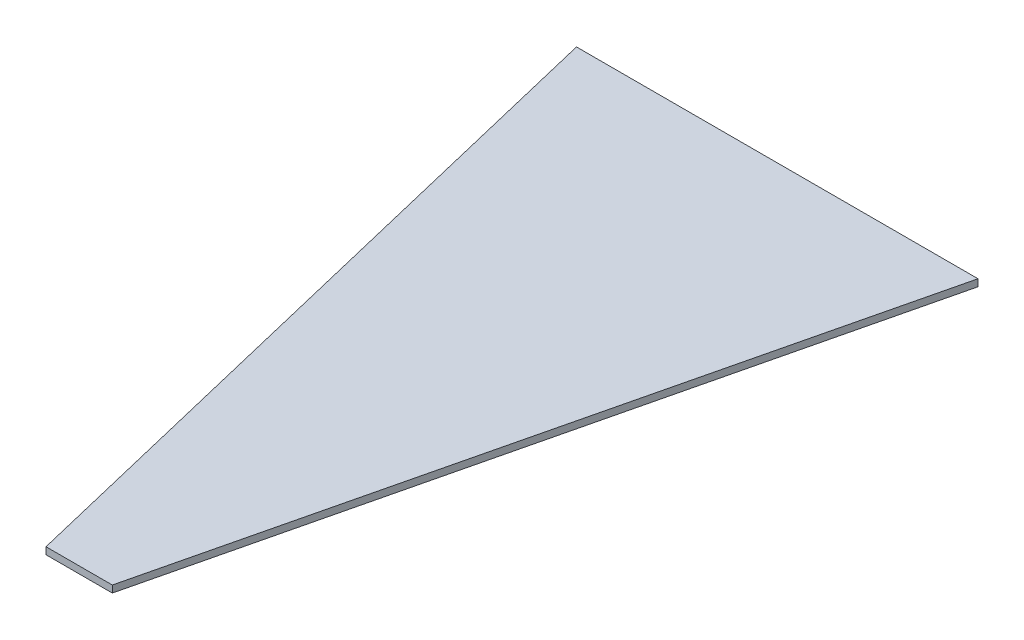
ISO-10303-21;
HEADER;
FILE_DESCRIPTION(('STEP AP214'),'2;1');
FILE_NAME('part.step','',(''),(''),'','','');
FILE_SCHEMA(('AUTOMOTIVE_DESIGN { 1 0 10303 214 1 1 1 1 }'));
ENDSEC;
DATA;
#1=APPLICATION_CONTEXT('core data for automotive mechanical design processes');
#2=APPLICATION_PROTOCOL_DEFINITION('international standard','automotive_design',2000,#1);
#3=PRODUCT_CONTEXT('',#1,'mechanical');
#4=PRODUCT('Part','Part','',(#3));
#5=PRODUCT_RELATED_PRODUCT_CATEGORY('part','',(#4));
#6=PRODUCT_DEFINITION_FORMATION('','',#4);
#7=PRODUCT_DEFINITION_CONTEXT('part definition',#1,'design');
#8=PRODUCT_DEFINITION('design','',#6,#7);
#9=PRODUCT_DEFINITION_SHAPE('','',#8);
#10=(LENGTH_UNIT() NAMED_UNIT(*) SI_UNIT(.MILLI.,.METRE.));
#11=(NAMED_UNIT(*) PLANE_ANGLE_UNIT() SI_UNIT($,.RADIAN.));
#12=(NAMED_UNIT(*) SI_UNIT($,.STERADIAN.) SOLID_ANGLE_UNIT());
#13=UNCERTAINTY_MEASURE_WITH_UNIT(LENGTH_MEASURE(1.E-05),#10,'distance_accuracy_value','');
#14=(GEOMETRIC_REPRESENTATION_CONTEXT(3) GLOBAL_UNCERTAINTY_ASSIGNED_CONTEXT((#13)) GLOBAL_UNIT_ASSIGNED_CONTEXT((#10,
#11,#12)) REPRESENTATION_CONTEXT('',''));
#15=CARTESIAN_POINT('',(0.,0.,0.));
#16=DIRECTION('',(0.,0.,1.));
#17=DIRECTION('',(1.,0.,0.));
#18=AXIS2_PLACEMENT_3D('',#15,#16,#17);
#19=CARTESIAN_POINT('',(-4.74999999999999,1.,0.));
#20=DIRECTION('',(0.,0.,-1.));
#21=DIRECTION('',(-1.,0.,0.));
#22=AXIS2_PLACEMENT_3D('',#19,#20,#21);
#23=PLANE('',#22);
#24=DIRECTION('',(1.,0.,0.));
#25=VECTOR('',#24,1.);
#26=CARTESIAN_POINT('',(-4.74999999999999,0.,0.));
#27=LINE('',#26,#25);
#28=CARTESIAN_POINT('',(-4.74999999999999,0.,0.));
#29=VERTEX_POINT('',#28);
#30=CARTESIAN_POINT('',(4.75000000000001,0.,0.));
#31=VERTEX_POINT('',#30);
#32=EDGE_CURVE('E111',#29,#31,#27,.T.);
#33=ORIENTED_EDGE('',*,*,#32,.T.);
#34=DIRECTION('',(0.,-1.,0.));
#35=VECTOR('',#34,1.);
#36=CARTESIAN_POINT('',(4.75000000000001,1.,0.));
#37=LINE('',#36,#35);
#38=CARTESIAN_POINT('',(4.75000000000001,1.,0.));
#39=VERTEX_POINT('',#38);
#40=EDGE_CURVE('E11',#39,#31,#37,.T.);
#41=ORIENTED_EDGE('',*,*,#40,.F.);
#42=DIRECTION('',(1.,0.,0.));
#43=VECTOR('',#42,1.);
#44=CARTESIAN_POINT('',(-4.74999999999999,1.,0.));
#45=LINE('',#44,#43);
#46=CARTESIAN_POINT('',(-4.74999999999999,1.,0.));
#47=VERTEX_POINT('',#46);
#48=EDGE_CURVE('E95',#47,#39,#45,.T.);
#49=ORIENTED_EDGE('',*,*,#48,.F.);
#50=DIRECTION('',(0.,-1.,0.));
#51=VECTOR('',#50,1.);
#52=CARTESIAN_POINT('',(-4.74999999999999,1.,0.));
#53=LINE('',#52,#51);
#54=EDGE_CURVE('E107',#47,#29,#53,.T.);
#55=ORIENTED_EDGE('',*,*,#54,.T.);
#56=EDGE_LOOP('',(#33,#41,#49,#55));
#57=FACE_BOUND('',#56,.T.);
#58=ADVANCED_FACE('F43',(#57),#23,.F.);
#59=CARTESIAN_POINT('',(4.75000000000001,1.,0.));
#60=DIRECTION('',(-0.972369920397677,0.,-0.233445363855902));
#61=DIRECTION('',(-0.233445363855902,0.,0.972369920397677));
#62=AXIS2_PLACEMENT_3D('',#59,#60,#61);
#63=PLANE('',#62);
#64=DIRECTION('',(0.233445363855902,0.,-0.972369920397677));
#65=VECTOR('',#64,1.);
#66=CARTESIAN_POINT('',(4.75000000000001,0.,0.));
#67=LINE('',#66,#65);
#68=CARTESIAN_POINT('',(28.7578759080113,0.,-100.));
#69=VERTEX_POINT('',#68);
#70=EDGE_CURVE('E100',#31,#69,#67,.T.);
#71=ORIENTED_EDGE('',*,*,#70,.T.);
#72=DIRECTION('',(0.,-1.,0.));
#73=VECTOR('',#72,1.);
#74=CARTESIAN_POINT('',(28.7578759080113,1.,-100.));
#75=LINE('',#74,#73);
#76=CARTESIAN_POINT('',(28.7578759080113,1.,-100.));
#77=VERTEX_POINT('',#76);
#78=EDGE_CURVE('E52',#77,#69,#75,.T.);
#79=ORIENTED_EDGE('',*,*,#78,.F.);
#80=DIRECTION('',(0.233445363855902,0.,-0.972369920397677));
#81=VECTOR('',#80,1.);
#82=CARTESIAN_POINT('',(4.75000000000001,1.,0.));
#83=LINE('',#82,#81);
#84=EDGE_CURVE('E90',#39,#77,#83,.T.);
#85=ORIENTED_EDGE('',*,*,#84,.F.);
#86=ORIENTED_EDGE('',*,*,#40,.T.);
#87=EDGE_LOOP('',(#71,#79,#85,#86));
#88=FACE_BOUND('',#87,.T.);
#89=ADVANCED_FACE('F99',(#88),#63,.F.);
#90=CARTESIAN_POINT('',(28.7578759080113,1.,-100.));
#91=DIRECTION('',(0.,0.,1.));
#92=DIRECTION('',(1.,0.,0.));
#93=AXIS2_PLACEMENT_3D('',#90,#91,#92);
#94=PLANE('',#93);
#95=DIRECTION('',(-1.,0.,0.));
#96=VECTOR('',#95,1.);
#97=CARTESIAN_POINT('',(28.7578759080113,0.,-100.));
#98=LINE('',#97,#96);
#99=CARTESIAN_POINT('',(-28.7578759080113,0.,-100.));
#100=VERTEX_POINT('',#99);
#101=EDGE_CURVE('E77',#69,#100,#98,.T.);
#102=ORIENTED_EDGE('',*,*,#101,.T.);
#103=DIRECTION('',(0.,-1.,0.));
#104=VECTOR('',#103,1.);
#105=CARTESIAN_POINT('',(-28.7578759080113,1.,-100.));
#106=LINE('',#105,#104);
#107=CARTESIAN_POINT('',(-28.7578759080113,1.,-100.));
#108=VERTEX_POINT('',#107);
#109=EDGE_CURVE('E102',#108,#100,#106,.T.);
#110=ORIENTED_EDGE('',*,*,#109,.F.);
#111=DIRECTION('',(-1.,0.,0.));
#112=VECTOR('',#111,1.);
#113=CARTESIAN_POINT('',(28.7578759080113,1.,-100.));
#114=LINE('',#113,#112);
#115=EDGE_CURVE('E93',#77,#108,#114,.T.);
#116=ORIENTED_EDGE('',*,*,#115,.F.);
#117=ORIENTED_EDGE('',*,*,#78,.T.);
#118=EDGE_LOOP('',(#102,#110,#116,#117));
#119=FACE_BOUND('',#118,.T.);
#120=ADVANCED_FACE('F103',(#119),#94,.F.);
#121=CARTESIAN_POINT('',(-28.7578759080113,1.,-100.));
#122=DIRECTION('',(0.972369920397677,0.,-0.233445363855903));
#123=DIRECTION('',(-0.233445363855903,0.,-0.972369920397677));
#124=AXIS2_PLACEMENT_3D('',#121,#122,#123);
#125=PLANE('',#124);
#126=DIRECTION('',(0.233445363855903,0.,0.972369920397677));
#127=VECTOR('',#126,1.);
#128=CARTESIAN_POINT('',(-28.7578759080113,0.,-100.));
#129=LINE('',#128,#127);
#130=EDGE_CURVE('E83',#100,#29,#129,.T.);
#131=ORIENTED_EDGE('',*,*,#130,.T.);
#132=ORIENTED_EDGE('',*,*,#54,.F.);
#133=DIRECTION('',(0.233445363855903,0.,0.972369920397677));
#134=VECTOR('',#133,1.);
#135=CARTESIAN_POINT('',(-28.7578759080113,1.,-100.));
#136=LINE('',#135,#134);
#137=EDGE_CURVE('E60',#108,#47,#136,.T.);
#138=ORIENTED_EDGE('',*,*,#137,.F.);
#139=ORIENTED_EDGE('',*,*,#109,.T.);
#140=EDGE_LOOP('',(#131,#132,#138,#139));
#141=FACE_BOUND('',#140,.T.);
#142=ADVANCED_FACE('F124',(#141),#125,.F.);
#143=CARTESIAN_POINT('',(0.,1.,0.));
#144=DIRECTION('',(0.,1.,0.));
#145=DIRECTION('',(0.,0.,1.));
#146=AXIS2_PLACEMENT_3D('',#143,#144,#145);
#147=PLANE('',#146);
#148=ORIENTED_EDGE('',*,*,#48,.T.);
#149=ORIENTED_EDGE('',*,*,#84,.T.);
#150=ORIENTED_EDGE('',*,*,#115,.T.);
#151=ORIENTED_EDGE('',*,*,#137,.T.);
#152=EDGE_LOOP('',(#148,#149,#150,#151));
#153=FACE_BOUND('',#152,.T.);
#154=ADVANCED_FACE('F91',(#153),#147,.T.);
#155=CARTESIAN_POINT('',(0.,0.,0.));
#156=DIRECTION('',(0.,1.,0.));
#157=DIRECTION('',(0.,0.,1.));
#158=AXIS2_PLACEMENT_3D('',#155,#156,#157);
#159=PLANE('',#158);
#160=ORIENTED_EDGE('',*,*,#32,.F.);
#161=ORIENTED_EDGE('',*,*,#130,.F.);
#162=ORIENTED_EDGE('',*,*,#101,.F.);
#163=ORIENTED_EDGE('',*,*,#70,.F.);
#164=EDGE_LOOP('',(#160,#161,#162,#163));
#165=FACE_BOUND('',#164,.T.);
#166=ADVANCED_FACE('F127',(#165),#159,.F.);
#167=CLOSED_SHELL('',(#58,#89,#120,#142,#154,#166));
#168=MANIFOLD_SOLID_BREP('B2',#167);
#169=ADVANCED_BREP_SHAPE_REPRESENTATION('',(#18,#168),#14);
#170=SHAPE_DEFINITION_REPRESENTATION(#9,#169);
ENDSEC;
END-ISO-10303-21;
